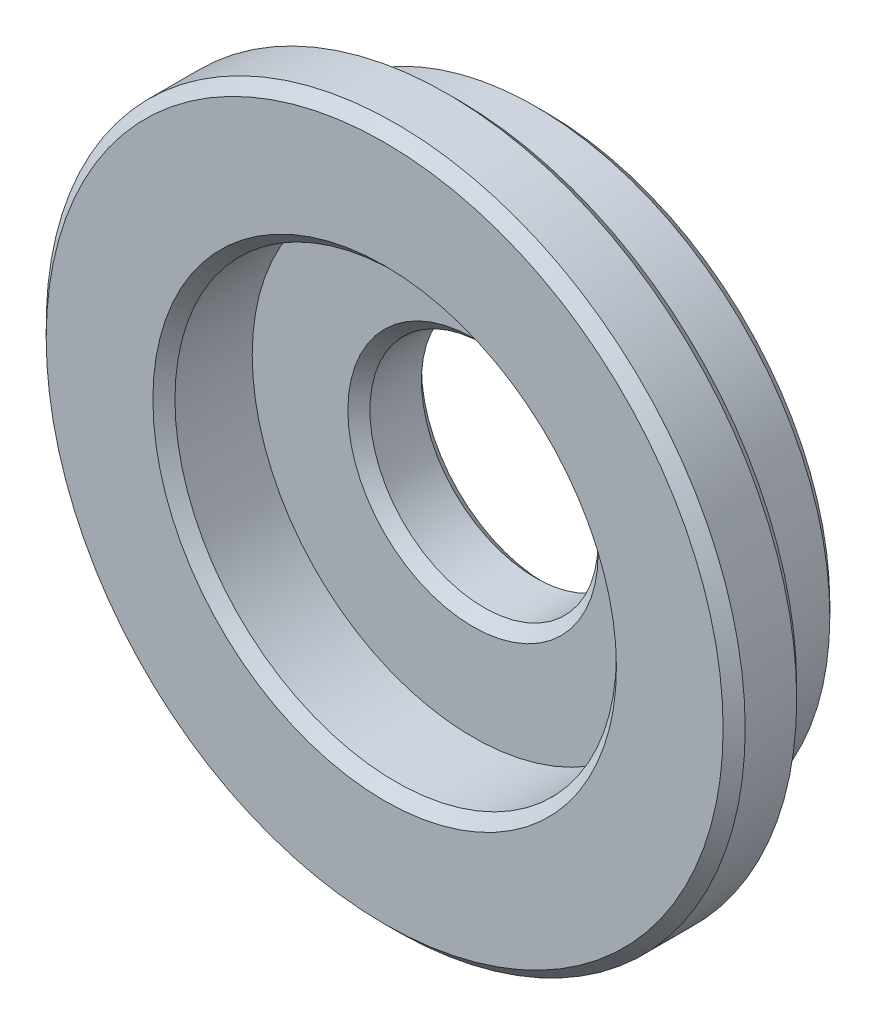
ISO-10303-21;
HEADER;
FILE_DESCRIPTION(('STEP AP214'),'2;1');
FILE_NAME('part.step','',(''),(''),'','','');
FILE_SCHEMA(('AUTOMOTIVE_DESIGN { 1 0 10303 214 1 1 1 1 }'));
ENDSEC;
DATA;
#1=APPLICATION_CONTEXT('core data for automotive mechanical design processes');
#2=APPLICATION_PROTOCOL_DEFINITION('international standard','automotive_design',2000,#1);
#3=PRODUCT_CONTEXT('',#1,'mechanical');
#4=PRODUCT('Part','Part','',(#3));
#5=PRODUCT_RELATED_PRODUCT_CATEGORY('part','',(#4));
#6=PRODUCT_DEFINITION_FORMATION('','',#4);
#7=PRODUCT_DEFINITION_CONTEXT('part definition',#1,'design');
#8=PRODUCT_DEFINITION('design','',#6,#7);
#9=PRODUCT_DEFINITION_SHAPE('','',#8);
#10=(LENGTH_UNIT() NAMED_UNIT(*) SI_UNIT(.MILLI.,.METRE.));
#11=(NAMED_UNIT(*) PLANE_ANGLE_UNIT() SI_UNIT($,.RADIAN.));
#12=(NAMED_UNIT(*) SI_UNIT($,.STERADIAN.) SOLID_ANGLE_UNIT());
#13=UNCERTAINTY_MEASURE_WITH_UNIT(LENGTH_MEASURE(1.E-05),#10,'distance_accuracy_value','');
#14=(GEOMETRIC_REPRESENTATION_CONTEXT(3) GLOBAL_UNCERTAINTY_ASSIGNED_CONTEXT((#13)) GLOBAL_UNIT_ASSIGNED_CONTEXT((#10,
#11,#12)) REPRESENTATION_CONTEXT('',''));
#15=CARTESIAN_POINT('',(0.,0.,0.));
#16=DIRECTION('',(0.,0.,1.));
#17=DIRECTION('',(1.,0.,0.));
#18=AXIS2_PLACEMENT_3D('',#15,#16,#17);
#19=CARTESIAN_POINT('',(0.,0.,0.850000000039108));
#20=DIRECTION('',(0.,0.,1.));
#21=DIRECTION('',(1.,0.,0.));
#22=AXIS2_PLACEMENT_3D('',#19,#20,#21);
#23=CONICAL_SURFACE('',#22,3.0000000000111,0.78539816339745);
#24=CARTESIAN_POINT('',(0.,0.,1.00000000008667));
#25=DIRECTION('',(0.,0.,1.));
#26=DIRECTION('',(1.,0.,0.));
#27=AXIS2_PLACEMENT_3D('',#24,#25,#26);
#28=CIRCLE('',#27,3.15000000005866);
#29=CARTESIAN_POINT('',(3.15000000005866,0.,1.00000000008667));
#30=VERTEX_POINT('',#29);
#31=EDGE_CURVE('E10',#30,#30,#28,.T.);
#32=ORIENTED_EDGE('',*,*,#31,.T.);
#33=EDGE_LOOP('',(#32));
#34=FACE_BOUND('',#33,.T.);
#35=CARTESIAN_POINT('',(0.,0.,0.850000000039108));
#36=DIRECTION('',(0.,0.,1.));
#37=DIRECTION('',(1.,0.,0.));
#38=AXIS2_PLACEMENT_3D('',#35,#36,#37);
#39=CIRCLE('',#38,3.0000000000111);
#40=CARTESIAN_POINT('',(3.0000000000111,0.,0.850000000039108));
#41=VERTEX_POINT('',#40);
#42=EDGE_CURVE('E78',#41,#41,#39,.T.);
#43=ORIENTED_EDGE('',*,*,#42,.F.);
#44=EDGE_LOOP('',(#43));
#45=FACE_BOUND('',#44,.T.);
#46=ADVANCED_FACE('F32',(#34,#45),#23,.F.);
#47=CARTESIAN_POINT('',(3.15000000005866,0.,1.00000000008667));
#48=DIRECTION('',(0.,0.,1.));
#49=DIRECTION('',(1.,0.,0.));
#50=AXIS2_PLACEMENT_3D('',#47,#48,#49);
#51=PLANE('',#50);
#52=CARTESIAN_POINT('',(0.,0.,1.00000000008667));
#53=DIRECTION('',(0.,0.,1.));
#54=DIRECTION('',(1.,0.,0.));
#55=AXIS2_PLACEMENT_3D('',#52,#53,#54);
#56=CIRCLE('',#55,4.59999999992206);
#57=CARTESIAN_POINT('',(4.59999999992206,0.,1.00000000008667));
#58=VERTEX_POINT('',#57);
#59=EDGE_CURVE('E38',#58,#58,#56,.T.);
#60=ORIENTED_EDGE('',*,*,#59,.T.);
#61=EDGE_LOOP('',(#60));
#62=FACE_BOUND('',#61,.T.);
#63=ORIENTED_EDGE('',*,*,#31,.F.);
#64=EDGE_LOOP('',(#63));
#65=FACE_BOUND('',#64,.T.);
#66=ADVANCED_FACE('F86',(#62,#65),#51,.T.);
#67=CARTESIAN_POINT('',(0.,0.,1.00000000008667));
#68=DIRECTION('',(0.,0.,-1.));
#69=DIRECTION('',(-1.,0.,0.));
#70=AXIS2_PLACEMENT_3D('',#67,#68,#69);
#71=CONICAL_SURFACE('',#70,4.59999999992206,0.785398163397447);
#72=CARTESIAN_POINT('',(0.,0.,0.850000000032741));
#73=DIRECTION('',(0.,0.,1.));
#74=DIRECTION('',(1.,0.,0.));
#75=AXIS2_PLACEMENT_3D('',#72,#73,#74);
#76=CIRCLE('',#75,4.74999999997599);
#77=CARTESIAN_POINT('',(4.74999999997599,0.,0.850000000032741));
#78=VERTEX_POINT('',#77);
#79=EDGE_CURVE('E42',#78,#78,#76,.T.);
#80=ORIENTED_EDGE('',*,*,#79,.T.);
#81=EDGE_LOOP('',(#80));
#82=FACE_BOUND('',#81,.T.);
#83=ORIENTED_EDGE('',*,*,#59,.F.);
#84=EDGE_LOOP('',(#83));
#85=FACE_BOUND('',#84,.T.);
#86=ADVANCED_FACE('F90',(#82,#85),#71,.T.);
#87=CARTESIAN_POINT('',(0.,0.,-1.20000000003984));
#88=DIRECTION('',(0.,0.,1.));
#89=DIRECTION('',(1.,0.,0.));
#90=AXIS2_PLACEMENT_3D('',#87,#88,#89);
#91=CYLINDRICAL_SURFACE('',#90,4.74999999997599);
#92=CARTESIAN_POINT('',(0.,0.,0.150000000051932));
#93=DIRECTION('',(0.,0.,1.));
#94=DIRECTION('',(1.,0.,0.));
#95=AXIS2_PLACEMENT_3D('',#92,#93,#94);
#96=CIRCLE('',#95,4.74999999997599);
#97=CARTESIAN_POINT('',(4.74999999997599,0.,0.150000000051932));
#98=VERTEX_POINT('',#97);
#99=EDGE_CURVE('E46',#98,#98,#96,.T.);
#100=ORIENTED_EDGE('',*,*,#99,.T.);
#101=EDGE_LOOP('',(#100));
#102=FACE_BOUND('',#101,.T.);
#103=ORIENTED_EDGE('',*,*,#79,.F.);
#104=EDGE_LOOP('',(#103));
#105=FACE_BOUND('',#104,.T.);
#106=ADVANCED_FACE('F94',(#102,#105),#91,.T.);
#107=CARTESIAN_POINT('',(0.,0.,0.150000000051932));
#108=DIRECTION('',(0.,0.,1.));
#109=DIRECTION('',(1.,0.,0.));
#110=AXIS2_PLACEMENT_3D('',#107,#108,#109);
#111=CONICAL_SURFACE('',#110,4.74999999997599,0.785398163397448);
#112=CARTESIAN_POINT('',(0.,0.,3.27418214068897E-11));
#113=DIRECTION('',(0.,0.,1.));
#114=DIRECTION('',(1.,0.,0.));
#115=AXIS2_PLACEMENT_3D('',#112,#113,#114);
#116=CIRCLE('',#115,4.5999999999568);
#117=CARTESIAN_POINT('',(4.5999999999568,0.,3.27418214068897E-11));
#118=VERTEX_POINT('',#117);
#119=EDGE_CURVE('E51',#118,#118,#116,.T.);
#120=ORIENTED_EDGE('',*,*,#119,.T.);
#121=EDGE_LOOP('',(#120));
#122=FACE_BOUND('',#121,.T.);
#123=ORIENTED_EDGE('',*,*,#99,.F.);
#124=EDGE_LOOP('',(#123));
#125=FACE_BOUND('',#124,.T.);
#126=ADVANCED_FACE('F101',(#122,#125),#111,.T.);
#127=CARTESIAN_POINT('',(4.5999999999568,0.,3.27417584953995E-11));
#128=DIRECTION('',(0.,0.,-1.));
#129=DIRECTION('',(-1.,0.,0.));
#130=AXIS2_PLACEMENT_3D('',#127,#128,#129);
#131=PLANE('',#130);
#132=CARTESIAN_POINT('',(0.,0.,3.27418214068897E-11));
#133=DIRECTION('',(0.,0.,1.));
#134=DIRECTION('',(1.,0.,0.));
#135=AXIS2_PLACEMENT_3D('',#132,#133,#134);
#136=CIRCLE('',#135,3.99999999995343);
#137=CARTESIAN_POINT('',(3.99999999995343,0.,3.27418214068897E-11));
#138=VERTEX_POINT('',#137);
#139=EDGE_CURVE('E54',#138,#138,#136,.T.);
#140=ORIENTED_EDGE('',*,*,#139,.T.);
#141=EDGE_LOOP('',(#140));
#142=FACE_BOUND('',#141,.T.);
#143=ORIENTED_EDGE('',*,*,#119,.F.);
#144=EDGE_LOOP('',(#143));
#145=FACE_BOUND('',#144,.T.);
#146=ADVANCED_FACE('F105',(#142,#145),#131,.T.);
#147=CARTESIAN_POINT('',(0.,0.,-1.20000000003984));
#148=DIRECTION('',(0.,0.,1.));
#149=DIRECTION('',(1.,0.,0.));
#150=AXIS2_PLACEMENT_3D('',#147,#148,#149);
#151=CYLINDRICAL_SURFACE('',#150,3.99999999995343);
#152=CARTESIAN_POINT('',(0.,0.,-1.05000000007749));
#153=DIRECTION('',(0.,0.,1.));
#154=DIRECTION('',(1.,0.,0.));
#155=AXIS2_PLACEMENT_3D('',#152,#153,#154);
#156=CIRCLE('',#155,3.99999999995343);
#157=CARTESIAN_POINT('',(3.99999999995343,0.,-1.05000000007749));
#158=VERTEX_POINT('',#157);
#159=EDGE_CURVE('E57',#158,#158,#156,.T.);
#160=ORIENTED_EDGE('',*,*,#159,.T.);
#161=EDGE_LOOP('',(#160));
#162=FACE_BOUND('',#161,.T.);
#163=ORIENTED_EDGE('',*,*,#139,.F.);
#164=EDGE_LOOP('',(#163));
#165=FACE_BOUND('',#164,.T.);
#166=ADVANCED_FACE('F109',(#162,#165),#151,.T.);
#167=CARTESIAN_POINT('',(0.,0.,-1.05000000007749));
#168=DIRECTION('',(0.,0.,1.));
#169=DIRECTION('',(1.,0.,0.));
#170=AXIS2_PLACEMENT_3D('',#167,#168,#169);
#171=CONICAL_SURFACE('',#170,3.99999999995343,0.785398163397449);
#172=CARTESIAN_POINT('',(0.,0.,-1.20000000003984));
#173=DIRECTION('',(0.,0.,1.));
#174=DIRECTION('',(1.,0.,0.));
#175=AXIS2_PLACEMENT_3D('',#172,#173,#174);
#176=CIRCLE('',#175,3.84999999999109);
#177=CARTESIAN_POINT('',(3.84999999999109,0.,-1.20000000003984));
#178=VERTEX_POINT('',#177);
#179=EDGE_CURVE('E60',#178,#178,#176,.T.);
#180=ORIENTED_EDGE('',*,*,#179,.T.);
#181=EDGE_LOOP('',(#180));
#182=FACE_BOUND('',#181,.T.);
#183=ORIENTED_EDGE('',*,*,#159,.F.);
#184=EDGE_LOOP('',(#183));
#185=FACE_BOUND('',#184,.T.);
#186=ADVANCED_FACE('F113',(#182,#185),#171,.T.);
#187=CARTESIAN_POINT('',(3.84999999999109,0.,-1.20000000003984));
#188=DIRECTION('',(0.,0.,-1.));
#189=DIRECTION('',(-1.,0.,0.));
#190=AXIS2_PLACEMENT_3D('',#187,#188,#189);
#191=PLANE('',#190);
#192=CARTESIAN_POINT('',(0.,0.,-1.20000000003984));
#193=DIRECTION('',(0.,0.,1.));
#194=DIRECTION('',(1.,0.,0.));
#195=AXIS2_PLACEMENT_3D('',#192,#193,#194);
#196=CIRCLE('',#195,1.70000000001919);
#197=CARTESIAN_POINT('',(1.70000000001919,0.,-1.20000000003984));
#198=VERTEX_POINT('',#197);
#199=EDGE_CURVE('E63',#198,#198,#196,.T.);
#200=ORIENTED_EDGE('',*,*,#199,.T.);
#201=EDGE_LOOP('',(#200));
#202=FACE_BOUND('',#201,.T.);
#203=ORIENTED_EDGE('',*,*,#179,.F.);
#204=EDGE_LOOP('',(#203));
#205=FACE_BOUND('',#204,.T.);
#206=ADVANCED_FACE('F117',(#202,#205),#191,.T.);
#207=CARTESIAN_POINT('',(0.,0.,-1.20000000003984));
#208=DIRECTION('',(0.,0.,-1.));
#209=DIRECTION('',(-1.,0.,0.));
#210=AXIS2_PLACEMENT_3D('',#207,#208,#209);
#211=CONICAL_SURFACE('',#210,1.70000000001919,0.785398163397448);
#212=CARTESIAN_POINT('',(0.,0.,-1.05000000002065));
#213=DIRECTION('',(0.,0.,1.));
#214=DIRECTION('',(1.,0.,0.));
#215=AXIS2_PLACEMENT_3D('',#212,#213,#214);
#216=CIRCLE('',#215,1.55);
#217=CARTESIAN_POINT('',(1.55,0.,-1.05000000002065));
#218=VERTEX_POINT('',#217);
#219=EDGE_CURVE('E66',#218,#218,#216,.T.);
#220=ORIENTED_EDGE('',*,*,#219,.T.);
#221=EDGE_LOOP('',(#220));
#222=FACE_BOUND('',#221,.T.);
#223=ORIENTED_EDGE('',*,*,#199,.F.);
#224=EDGE_LOOP('',(#223));
#225=FACE_BOUND('',#224,.T.);
#226=ADVANCED_FACE('F121',(#222,#225),#211,.F.);
#227=CARTESIAN_POINT('',(0.,0.,-1.20000000003984));
#228=DIRECTION('',(0.,0.,1.));
#229=DIRECTION('',(1.,0.,0.));
#230=AXIS2_PLACEMENT_3D('',#227,#228,#229);
#231=CYLINDRICAL_SURFACE('',#230,1.55);
#232=CARTESIAN_POINT('',(0.,0.,-0.35));
#233=DIRECTION('',(0.,0.,1.));
#234=DIRECTION('',(1.,0.,0.));
#235=AXIS2_PLACEMENT_3D('',#232,#233,#234);
#236=CIRCLE('',#235,1.55);
#237=CARTESIAN_POINT('',(1.55,0.,-0.35));
#238=VERTEX_POINT('',#237);
#239=EDGE_CURVE('E69',#238,#238,#236,.T.);
#240=ORIENTED_EDGE('',*,*,#239,.T.);
#241=EDGE_LOOP('',(#240));
#242=FACE_BOUND('',#241,.T.);
#243=ORIENTED_EDGE('',*,*,#219,.F.);
#244=EDGE_LOOP('',(#243));
#245=FACE_BOUND('',#244,.T.);
#246=ADVANCED_FACE('F125',(#242,#245),#231,.F.);
#247=CARTESIAN_POINT('',(0.,0.,-0.35));
#248=DIRECTION('',(0.,0.,1.));
#249=DIRECTION('',(1.,0.,0.));
#250=AXIS2_PLACEMENT_3D('',#247,#248,#249);
#251=CONICAL_SURFACE('',#250,1.55,0.785398163397448);
#252=CARTESIAN_POINT('',(0.,0.,-0.199999999960892));
#253=DIRECTION('',(0.,0.,1.));
#254=DIRECTION('',(1.,0.,0.));
#255=AXIS2_PLACEMENT_3D('',#252,#253,#254);
#256=CIRCLE('',#255,1.70000000003911);
#257=CARTESIAN_POINT('',(1.70000000003911,0.,-0.199999999960892));
#258=VERTEX_POINT('',#257);
#259=EDGE_CURVE('E72',#258,#258,#256,.T.);
#260=ORIENTED_EDGE('',*,*,#259,.T.);
#261=EDGE_LOOP('',(#260));
#262=FACE_BOUND('',#261,.T.);
#263=ORIENTED_EDGE('',*,*,#239,.F.);
#264=EDGE_LOOP('',(#263));
#265=FACE_BOUND('',#264,.T.);
#266=ADVANCED_FACE('F129',(#262,#265),#251,.F.);
#267=CARTESIAN_POINT('',(1.70000000003911,0.,-0.199999999960892));
#268=DIRECTION('',(0.,0.,1.));
#269=DIRECTION('',(1.,0.,0.));
#270=AXIS2_PLACEMENT_3D('',#267,#268,#269);
#271=PLANE('',#270);
#272=CARTESIAN_POINT('',(0.,0.,-0.199999999960892));
#273=DIRECTION('',(0.,0.,1.));
#274=DIRECTION('',(1.,0.,0.));
#275=AXIS2_PLACEMENT_3D('',#272,#273,#274);
#276=CIRCLE('',#275,3.0000000000111);
#277=CARTESIAN_POINT('',(3.0000000000111,0.,-0.199999999960892));
#278=VERTEX_POINT('',#277);
#279=EDGE_CURVE('E75',#278,#278,#276,.T.);
#280=ORIENTED_EDGE('',*,*,#279,.T.);
#281=EDGE_LOOP('',(#280));
#282=FACE_BOUND('',#281,.T.);
#283=ORIENTED_EDGE('',*,*,#259,.F.);
#284=EDGE_LOOP('',(#283));
#285=FACE_BOUND('',#284,.T.);
#286=ADVANCED_FACE('F133',(#282,#285),#271,.T.);
#287=CARTESIAN_POINT('',(0.,0.,-1.20000000003984));
#288=DIRECTION('',(0.,0.,1.));
#289=DIRECTION('',(1.,0.,0.));
#290=AXIS2_PLACEMENT_3D('',#287,#288,#289);
#291=CYLINDRICAL_SURFACE('',#290,3.0000000000111);
#292=ORIENTED_EDGE('',*,*,#42,.T.);
#293=EDGE_LOOP('',(#292));
#294=FACE_BOUND('',#293,.T.);
#295=ORIENTED_EDGE('',*,*,#279,.F.);
#296=EDGE_LOOP('',(#295));
#297=FACE_BOUND('',#296,.T.);
#298=ADVANCED_FACE('F82',(#294,#297),#291,.F.);
#299=CLOSED_SHELL('',(#46,#66,#86,#106,#126,#146,#166,#186,#206,#226,#246,#266,#286,#298));
#300=MANIFOLD_SOLID_BREP('B2',#299);
#301=ADVANCED_BREP_SHAPE_REPRESENTATION('',(#18,#300),#14);
#302=SHAPE_DEFINITION_REPRESENTATION(#9,#301);
ENDSEC;
END-ISO-10303-21;
